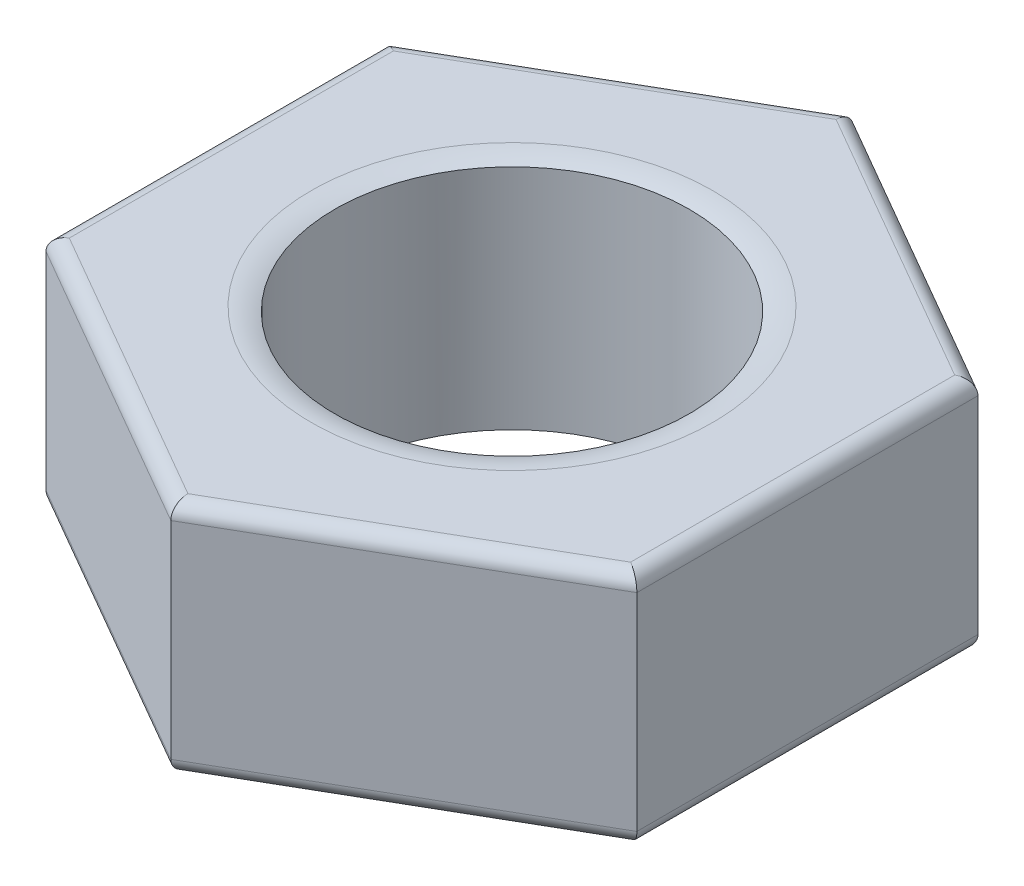
ISO-10303-21;
HEADER;
FILE_DESCRIPTION(('STEP AP214'),'2;1');
FILE_NAME('part.step','',(''),(''),'','','');
FILE_SCHEMA(('AUTOMOTIVE_DESIGN { 1 0 10303 214 1 1 1 1 }'));
ENDSEC;
DATA;
#1=APPLICATION_CONTEXT('core data for automotive mechanical design processes');
#2=APPLICATION_PROTOCOL_DEFINITION('international standard','automotive_design',2000,#1);
#3=PRODUCT_CONTEXT('',#1,'mechanical');
#4=PRODUCT('Part','Part','',(#3));
#5=PRODUCT_RELATED_PRODUCT_CATEGORY('part','',(#4));
#6=PRODUCT_DEFINITION_FORMATION('','',#4);
#7=PRODUCT_DEFINITION_CONTEXT('part definition',#1,'design');
#8=PRODUCT_DEFINITION('design','',#6,#7);
#9=PRODUCT_DEFINITION_SHAPE('','',#8);
#10=(LENGTH_UNIT() NAMED_UNIT(*) SI_UNIT(.MILLI.,.METRE.));
#11=(NAMED_UNIT(*) PLANE_ANGLE_UNIT() SI_UNIT($,.RADIAN.));
#12=(NAMED_UNIT(*) SI_UNIT($,.STERADIAN.) SOLID_ANGLE_UNIT());
#13=UNCERTAINTY_MEASURE_WITH_UNIT(LENGTH_MEASURE(1.E-05),#10,'distance_accuracy_value','');
#14=(GEOMETRIC_REPRESENTATION_CONTEXT(3) GLOBAL_UNCERTAINTY_ASSIGNED_CONTEXT((#13)) GLOBAL_UNIT_ASSIGNED_CONTEXT((#10,
#11,#12)) REPRESENTATION_CONTEXT('',''));
#15=CARTESIAN_POINT('',(0.,0.,0.));
#16=DIRECTION('',(0.,0.,1.));
#17=DIRECTION('',(1.,0.,0.));
#18=AXIS2_PLACEMENT_3D('',#15,#16,#17);
#19=CARTESIAN_POINT('',(0.,2.,0.));
#20=DIRECTION('',(0.,1.,0.));
#21=DIRECTION('',(0.,0.,1.));
#22=AXIS2_PLACEMENT_3D('',#19,#20,#21);
#23=PLANE('',#22);
#24=DIRECTION('',(0.,0.,-1.));
#25=VECTOR('',#24,1.);
#26=CARTESIAN_POINT('',(2.37499999999998,2.,-1.44337567297409));
#27=LINE('',#26,#25);
#28=CARTESIAN_POINT('',(2.37500000000001,2.,1.37120688932534));
#29=VERTEX_POINT('',#28);
#30=CARTESIAN_POINT('',(2.37499999999998,2.,-1.37120688932539));
#31=VERTEX_POINT('',#30);
#32=EDGE_CURVE('E44',#29,#31,#27,.T.);
#33=ORIENTED_EDGE('',*,*,#32,.T.);
#34=DIRECTION('',(-0.866025403784442,0.,-0.499999999999995));
#35=VECTOR('',#34,1.);
#36=CARTESIAN_POINT('',(-0.0624999999999998,2.,-2.77849817047507));
#37=LINE('',#36,#35);
#38=CARTESIAN_POINT('',(0.,2.,-2.74241377865072));
#39=VERTEX_POINT('',#38);
#40=EDGE_CURVE('E11',#31,#39,#37,.T.);
#41=ORIENTED_EDGE('',*,*,#40,.T.);
#42=DIRECTION('',(-0.866025403784438,0.,0.500000000000001));
#43=VECTOR('',#42,1.);
#44=CARTESIAN_POINT('',(-2.4375,2.,-1.335122497501));
#45=LINE('',#44,#43);
#46=CARTESIAN_POINT('',(-2.375,2.,-1.37120688932535));
#47=VERTEX_POINT('',#46);
#48=EDGE_CURVE('E208',#39,#47,#45,.T.);
#49=ORIENTED_EDGE('',*,*,#48,.T.);
#50=DIRECTION('',(0.,0.,1.));
#51=VECTOR('',#50,1.);
#52=CARTESIAN_POINT('',(-2.37499999999999,2.,1.44337567297407));
#53=LINE('',#52,#51);
#54=CARTESIAN_POINT('',(-2.37499999999999,2.,1.37120688932537));
#55=VERTEX_POINT('',#54);
#56=EDGE_CURVE('E210',#47,#55,#53,.T.);
#57=ORIENTED_EDGE('',*,*,#56,.T.);
#58=DIRECTION('',(0.866025403784441,0.,0.499999999999995));
#59=VECTOR('',#58,1.);
#60=CARTESIAN_POINT('',(0.0625000000000196,2.,2.77849817047507));
#61=LINE('',#60,#59);
#62=CARTESIAN_POINT('',(0.,2.,2.74241377865072));
#63=VERTEX_POINT('',#62);
#64=EDGE_CURVE('E212',#55,#63,#61,.T.);
#65=ORIENTED_EDGE('',*,*,#64,.T.);
#66=DIRECTION('',(0.866025403784435,0.,-0.500000000000007));
#67=VECTOR('',#66,1.);
#68=CARTESIAN_POINT('',(2.43750000000001,2.,1.33512249750098));
#69=LINE('',#68,#67);
#70=EDGE_CURVE('E55',#63,#29,#69,.T.);
#71=ORIENTED_EDGE('',*,*,#70,.T.);
#72=EDGE_LOOP('',(#33,#41,#49,#57,#65,#71));
#73=FACE_BOUND('',#72,.T.);
#74=CARTESIAN_POINT('',(0.,2.,0.));
#75=DIRECTION('',(0.,-1.,0.));
#76=DIRECTION('',(0.,0.,-1.));
#77=AXIS2_PLACEMENT_3D('',#74,#75,#76);
#78=CIRCLE('',#77,1.69948554329983);
#79=CARTESIAN_POINT('',(0.,2.,-1.69948554329983));
#80=VERTEX_POINT('',#79);
#81=EDGE_CURVE('E166',#80,#80,#78,.T.);
#82=ORIENTED_EDGE('',*,*,#81,.T.);
#83=EDGE_LOOP('',(#82));
#84=FACE_BOUND('',#83,.T.);
#85=ADVANCED_FACE('F35',(#73,#84),#23,.T.);
#86=CARTESIAN_POINT('',(0.,0.,0.));
#87=DIRECTION('',(0.,1.,0.));
#88=DIRECTION('',(0.,0.,1.));
#89=AXIS2_PLACEMENT_3D('',#86,#87,#88);
#90=PLANE('',#89);
#91=DIRECTION('',(-0.866025403784442,0.,-0.499999999999995));
#92=VECTOR('',#91,1.);
#93=CARTESIAN_POINT('',(1.18749999999999,0.,-2.05681033398805));
#94=LINE('',#93,#92);
#95=CARTESIAN_POINT('',(0.,0.,-2.74241377865072));
#96=VERTEX_POINT('',#95);
#97=CARTESIAN_POINT('',(2.37499999999998,0.,-1.37120688932539));
#98=VERTEX_POINT('',#97);
#99=EDGE_CURVE('E187',#96,#98,#94,.F.);
#100=ORIENTED_EDGE('',*,*,#99,.T.);
#101=DIRECTION('',(0.,0.,-1.));
#102=VECTOR('',#101,1.);
#103=CARTESIAN_POINT('',(2.37499999999999,0.,0.));
#104=LINE('',#103,#102);
#105=CARTESIAN_POINT('',(2.37500000000001,0.,1.37120688932534));
#106=VERTEX_POINT('',#105);
#107=EDGE_CURVE('E152',#98,#106,#104,.F.);
#108=ORIENTED_EDGE('',*,*,#107,.T.);
#109=DIRECTION('',(0.866025403784435,0.,-0.500000000000007));
#110=VECTOR('',#109,1.);
#111=CARTESIAN_POINT('',(1.18750000000001,0.,2.05681033398803));
#112=LINE('',#111,#110);
#113=CARTESIAN_POINT('',(0.,0.,2.74241377865072));
#114=VERTEX_POINT('',#113);
#115=EDGE_CURVE('E179',#106,#114,#112,.F.);
#116=ORIENTED_EDGE('',*,*,#115,.T.);
#117=DIRECTION('',(0.866025403784441,0.,0.499999999999995));
#118=VECTOR('',#117,1.);
#119=CARTESIAN_POINT('',(-1.18749999999999,0.,2.05681033398804));
#120=LINE('',#119,#118);
#121=CARTESIAN_POINT('',(-2.37499999999999,0.,1.37120688932537));
#122=VERTEX_POINT('',#121);
#123=EDGE_CURVE('E181',#114,#122,#120,.F.);
#124=ORIENTED_EDGE('',*,*,#123,.T.);
#125=DIRECTION('',(0.,0.,1.));
#126=VECTOR('',#125,1.);
#127=CARTESIAN_POINT('',(-2.37499999999999,0.,0.));
#128=LINE('',#127,#126);
#129=CARTESIAN_POINT('',(-2.375,0.,-1.37120688932535));
#130=VERTEX_POINT('',#129);
#131=EDGE_CURVE('E183',#122,#130,#128,.F.);
#132=ORIENTED_EDGE('',*,*,#131,.T.);
#133=DIRECTION('',(-0.866025403784438,0.,0.500000000000001));
#134=VECTOR('',#133,1.);
#135=CARTESIAN_POINT('',(-1.1875,0.,-2.05681033398804));
#136=LINE('',#135,#134);
#137=EDGE_CURVE('E185',#130,#96,#136,.F.);
#138=ORIENTED_EDGE('',*,*,#137,.T.);
#139=EDGE_LOOP('',(#100,#108,#116,#124,#132,#138));
#140=FACE_BOUND('',#139,.T.);
#141=CARTESIAN_POINT('',(0.,0.,0.));
#142=DIRECTION('',(0.,-1.,0.));
#143=DIRECTION('',(0.,0.,-1.));
#144=AXIS2_PLACEMENT_3D('',#141,#142,#143);
#145=CIRCLE('',#144,1.69948554329983);
#146=CARTESIAN_POINT('',(0.,0.,-1.69948554329983));
#147=VERTEX_POINT('',#146);
#148=EDGE_CURVE('E245',#147,#147,#145,.T.);
#149=ORIENTED_EDGE('',*,*,#148,.F.);
#150=EDGE_LOOP('',(#149));
#151=FACE_BOUND('',#150,.T.);
#152=ADVANCED_FACE('F253',(#140,#151),#90,.F.);
#153=CARTESIAN_POINT('',(2.49999999999998,2.,-1.44337567297409));
#154=DIRECTION('',(-0.499999999999995,0.,0.866025403784441));
#155=DIRECTION('',(0.866025403784442,0.,0.499999999999995));
#156=AXIS2_PLACEMENT_3D('',#153,#154,#155);
#157=PLANE('',#156);
#158=DIRECTION('',(0.,-1.,0.));
#159=VECTOR('',#158,1.);
#160=CARTESIAN_POINT('',(2.49999999999998,2.,-1.44337567297409));
#161=LINE('',#160,#159);
#162=CARTESIAN_POINT('',(2.49999999999998,1.875,-1.44337567297409));
#163=VERTEX_POINT('',#162);
#164=CARTESIAN_POINT('',(2.49999999999998,0.125,-1.44337567297409));
#165=VERTEX_POINT('',#164);
#166=EDGE_CURVE('E149',#163,#165,#161,.T.);
#167=ORIENTED_EDGE('',*,*,#166,.T.);
#168=DIRECTION('',(-0.866025403784442,0.,-0.499999999999995));
#169=VECTOR('',#168,1.);
#170=CARTESIAN_POINT('',(2.49999999999998,0.125,-1.44337567297409));
#171=LINE('',#170,#169);
#172=CARTESIAN_POINT('',(0.,0.125,-2.88675134594812));
#173=VERTEX_POINT('',#172);
#174=EDGE_CURVE('E151',#165,#173,#171,.T.);
#175=ORIENTED_EDGE('',*,*,#174,.T.);
#176=DIRECTION('',(0.,-1.,0.));
#177=VECTOR('',#176,1.);
#178=CARTESIAN_POINT('',(0.,2.,-2.88675134594812));
#179=LINE('',#178,#177);
#180=CARTESIAN_POINT('',(0.,1.875,-2.88675134594812));
#181=VERTEX_POINT('',#180);
#182=EDGE_CURVE('E143',#181,#173,#179,.T.);
#183=ORIENTED_EDGE('',*,*,#182,.F.);
#184=DIRECTION('',(-0.866025403784442,0.,-0.499999999999995));
#185=VECTOR('',#184,1.);
#186=CARTESIAN_POINT('',(2.49999999999998,1.875,-1.44337567297409));
#187=LINE('',#186,#185);
#188=EDGE_CURVE('E128',#181,#163,#187,.F.);
#189=ORIENTED_EDGE('',*,*,#188,.T.);
#190=EDGE_LOOP('',(#167,#175,#183,#189));
#191=FACE_BOUND('',#190,.T.);
#192=ADVANCED_FACE('F148',(#191),#157,.F.);
#193=CARTESIAN_POINT('',(0.,2.,-2.88675134594812));
#194=DIRECTION('',(0.500000000000001,0.,0.866025403784438));
#195=DIRECTION('',(0.866025403784438,0.,-0.500000000000001));
#196=AXIS2_PLACEMENT_3D('',#193,#194,#195);
#197=PLANE('',#196);
#198=ORIENTED_EDGE('',*,*,#182,.T.);
#199=DIRECTION('',(-0.866025403784438,0.,0.500000000000001));
#200=VECTOR('',#199,1.);
#201=CARTESIAN_POINT('',(0.,0.125,-2.88675134594812));
#202=LINE('',#201,#200);
#203=CARTESIAN_POINT('',(-2.5,0.125,-1.44337567297406));
#204=VERTEX_POINT('',#203);
#205=EDGE_CURVE('E194',#173,#204,#202,.T.);
#206=ORIENTED_EDGE('',*,*,#205,.T.);
#207=DIRECTION('',(0.,-1.,0.));
#208=VECTOR('',#207,1.);
#209=CARTESIAN_POINT('',(-2.5,2.,-1.44337567297406));
#210=LINE('',#209,#208);
#211=CARTESIAN_POINT('',(-2.5,1.875,-1.44337567297406));
#212=VERTEX_POINT('',#211);
#213=EDGE_CURVE('E174',#212,#204,#210,.T.);
#214=ORIENTED_EDGE('',*,*,#213,.F.);
#215=DIRECTION('',(-0.866025403784438,0.,0.500000000000001));
#216=VECTOR('',#215,1.);
#217=CARTESIAN_POINT('',(0.,1.875,-2.88675134594812));
#218=LINE('',#217,#216);
#219=EDGE_CURVE('E192',#212,#181,#218,.F.);
#220=ORIENTED_EDGE('',*,*,#219,.T.);
#221=EDGE_LOOP('',(#198,#206,#214,#220));
#222=FACE_BOUND('',#221,.T.);
#223=ADVANCED_FACE('F261',(#222),#197,.F.);
#224=CARTESIAN_POINT('',(-2.5,2.,-1.44337567297406));
#225=DIRECTION('',(1.,0.,0.));
#226=DIRECTION('',(0.,0.,-1.));
#227=AXIS2_PLACEMENT_3D('',#224,#225,#226);
#228=PLANE('',#227);
#229=ORIENTED_EDGE('',*,*,#213,.T.);
#230=DIRECTION('',(0.,0.,1.));
#231=VECTOR('',#230,1.);
#232=CARTESIAN_POINT('',(-2.5,0.125,-1.44337567297406));
#233=LINE('',#232,#231);
#234=CARTESIAN_POINT('',(-2.49999999999999,0.125,1.44337567297407));
#235=VERTEX_POINT('',#234);
#236=EDGE_CURVE('E198',#204,#235,#233,.T.);
#237=ORIENTED_EDGE('',*,*,#236,.T.);
#238=DIRECTION('',(0.,-1.,0.));
#239=VECTOR('',#238,1.);
#240=CARTESIAN_POINT('',(-2.49999999999999,2.,1.44337567297407));
#241=LINE('',#240,#239);
#242=CARTESIAN_POINT('',(-2.49999999999999,1.875,1.44337567297407));
#243=VERTEX_POINT('',#242);
#244=EDGE_CURVE('E171',#243,#235,#241,.T.);
#245=ORIENTED_EDGE('',*,*,#244,.F.);
#246=DIRECTION('',(0.,0.,1.));
#247=VECTOR('',#246,1.);
#248=CARTESIAN_POINT('',(-2.5,1.875,-1.44337567297406));
#249=LINE('',#248,#247);
#250=EDGE_CURVE('E196',#243,#212,#249,.F.);
#251=ORIENTED_EDGE('',*,*,#250,.T.);
#252=EDGE_LOOP('',(#229,#237,#245,#251));
#253=FACE_BOUND('',#252,.T.);
#254=ADVANCED_FACE('F276',(#253),#228,.F.);
#255=CARTESIAN_POINT('',(-2.49999999999999,2.,1.44337567297407));
#256=DIRECTION('',(0.499999999999995,0.,-0.866025403784441));
#257=DIRECTION('',(-0.866025403784441,0.,-0.499999999999995));
#258=AXIS2_PLACEMENT_3D('',#255,#256,#257);
#259=PLANE('',#258);
#260=ORIENTED_EDGE('',*,*,#244,.T.);
#261=DIRECTION('',(0.866025403784441,0.,0.499999999999995));
#262=VECTOR('',#261,1.);
#263=CARTESIAN_POINT('',(-2.49999999999999,0.125,1.44337567297407));
#264=LINE('',#263,#262);
#265=CARTESIAN_POINT('',(0.,0.125,2.88675134594812));
#266=VERTEX_POINT('',#265);
#267=EDGE_CURVE('E202',#235,#266,#264,.T.);
#268=ORIENTED_EDGE('',*,*,#267,.T.);
#269=DIRECTION('',(0.,-1.,0.));
#270=VECTOR('',#269,1.);
#271=CARTESIAN_POINT('',(0.,2.,2.88675134594812));
#272=LINE('',#271,#270);
#273=CARTESIAN_POINT('',(0.,1.875,2.88675134594812));
#274=VERTEX_POINT('',#273);
#275=EDGE_CURVE('E160',#274,#266,#272,.T.);
#276=ORIENTED_EDGE('',*,*,#275,.F.);
#277=DIRECTION('',(0.866025403784441,0.,0.499999999999995));
#278=VECTOR('',#277,1.);
#279=CARTESIAN_POINT('',(-2.49999999999999,1.875,1.44337567297407));
#280=LINE('',#279,#278);
#281=EDGE_CURVE('E200',#274,#243,#280,.F.);
#282=ORIENTED_EDGE('',*,*,#281,.T.);
#283=EDGE_LOOP('',(#260,#268,#276,#282));
#284=FACE_BOUND('',#283,.T.);
#285=ADVANCED_FACE('F272',(#284),#259,.F.);
#286=CARTESIAN_POINT('',(0.,2.,2.88675134594812));
#287=DIRECTION('',(-0.500000000000007,0.,-0.866025403784435));
#288=DIRECTION('',(-0.866025403784435,0.,0.500000000000007));
#289=AXIS2_PLACEMENT_3D('',#286,#287,#288);
#290=PLANE('',#289);
#291=ORIENTED_EDGE('',*,*,#275,.T.);
#292=DIRECTION('',(0.866025403784435,0.,-0.500000000000007));
#293=VECTOR('',#292,1.);
#294=CARTESIAN_POINT('',(0.,0.125,2.88675134594812));
#295=LINE('',#294,#293);
#296=CARTESIAN_POINT('',(2.50000000000001,0.125,1.44337567297404));
#297=VERTEX_POINT('',#296);
#298=EDGE_CURVE('E206',#266,#297,#295,.T.);
#299=ORIENTED_EDGE('',*,*,#298,.T.);
#300=DIRECTION('',(0.,-1.,0.));
#301=VECTOR('',#300,1.);
#302=CARTESIAN_POINT('',(2.50000000000001,2.,1.44337567297404));
#303=LINE('',#302,#301);
#304=CARTESIAN_POINT('',(2.50000000000001,1.875,1.44337567297404));
#305=VERTEX_POINT('',#304);
#306=EDGE_CURVE('E157',#305,#297,#303,.T.);
#307=ORIENTED_EDGE('',*,*,#306,.F.);
#308=DIRECTION('',(0.866025403784435,0.,-0.500000000000007));
#309=VECTOR('',#308,1.);
#310=CARTESIAN_POINT('',(0.,1.875,2.88675134594812));
#311=LINE('',#310,#309);
#312=EDGE_CURVE('E204',#305,#274,#311,.F.);
#313=ORIENTED_EDGE('',*,*,#312,.T.);
#314=EDGE_LOOP('',(#291,#299,#307,#313));
#315=FACE_BOUND('',#314,.T.);
#316=ADVANCED_FACE('F269',(#315),#290,.F.);
#317=CARTESIAN_POINT('',(2.50000000000001,2.,1.44337567297404));
#318=DIRECTION('',(-1.,0.,0.));
#319=DIRECTION('',(0.,0.,1.));
#320=AXIS2_PLACEMENT_3D('',#317,#318,#319);
#321=PLANE('',#320);
#322=ORIENTED_EDGE('',*,*,#306,.T.);
#323=DIRECTION('',(0.,0.,-1.));
#324=VECTOR('',#323,1.);
#325=CARTESIAN_POINT('',(2.50000000000001,0.125,1.44337567297404));
#326=LINE('',#325,#324);
#327=EDGE_CURVE('E142',#297,#165,#326,.T.);
#328=ORIENTED_EDGE('',*,*,#327,.T.);
#329=ORIENTED_EDGE('',*,*,#166,.F.);
#330=DIRECTION('',(0.,0.,-1.));
#331=VECTOR('',#330,1.);
#332=CARTESIAN_POINT('',(2.50000000000001,1.875,1.44337567297404));
#333=LINE('',#332,#331);
#334=EDGE_CURVE('E135',#163,#305,#333,.F.);
#335=ORIENTED_EDGE('',*,*,#334,.T.);
#336=EDGE_LOOP('',(#322,#328,#329,#335));
#337=FACE_BOUND('',#336,.T.);
#338=ADVANCED_FACE('F155',(#337),#321,.F.);
#339=CARTESIAN_POINT('',(0.,2.,0.));
#340=DIRECTION('',(0.,-1.,0.));
#341=DIRECTION('',(0.,0.,-1.));
#342=AXIS2_PLACEMENT_3D('',#339,#340,#341);
#343=CYLINDRICAL_SURFACE('',#342,1.5);
#344=CARTESIAN_POINT('',(0.,0.0364440834975765,0.));
#345=DIRECTION('',(0.,1.,0.));
#346=DIRECTION('',(0.,0.,1.));
#347=AXIS2_PLACEMENT_3D('',#344,#345,#346);
#348=CIRCLE('',#347,1.5);
#349=CARTESIAN_POINT('',(0.,0.0364440834975769,1.5));
#350=VERTEX_POINT('',#349);
#351=EDGE_CURVE('E39',#350,#350,#348,.T.);
#352=ORIENTED_EDGE('',*,*,#351,.F.);
#353=EDGE_LOOP('',(#352));
#354=FACE_BOUND('',#353,.T.);
#355=CARTESIAN_POINT('',(0.,1.96355591650242,0.));
#356=DIRECTION('',(0.,-1.,0.));
#357=DIRECTION('',(0.,0.,-1.));
#358=AXIS2_PLACEMENT_3D('',#355,#356,#357);
#359=CIRCLE('',#358,1.5);
#360=CARTESIAN_POINT('',(0.,1.96355591650242,-1.5));
#361=VERTEX_POINT('',#360);
#362=EDGE_CURVE('E229',#361,#361,#359,.T.);
#363=ORIENTED_EDGE('',*,*,#362,.F.);
#364=EDGE_LOOP('',(#363));
#365=FACE_BOUND('',#364,.T.);
#366=ADVANCED_FACE('F268',(#354,#365),#343,.F.);
#367=CARTESIAN_POINT('',(-2.375,0.125,-1.44337567297406));
#368=DIRECTION('',(0.,0.,1.));
#369=DIRECTION('',(1.,0.,0.));
#370=AXIS2_PLACEMENT_3D('',#367,#368,#369);
#371=CYLINDRICAL_SURFACE('',#370,0.125);
#372=CARTESIAN_POINT('',(-2.375,0.125,-1.37120688932535));
#373=DIRECTION('',(-0.499999999999998,0.,0.86602540378444));
#374=DIRECTION('',(0.86602540378444,0.,0.499999999999998));
#375=AXIS2_PLACEMENT_3D('',#372,#373,#374);
#376=ELLIPSE('',#375,0.144337567297407,0.125);
#377=EDGE_CURVE('E163',#130,#204,#376,.F.);
#378=ORIENTED_EDGE('',*,*,#377,.F.);
#379=ORIENTED_EDGE('',*,*,#131,.F.);
#380=CARTESIAN_POINT('',(-2.37499999999999,0.125,1.37120688932537));
#381=DIRECTION('',(0.500000000000004,0.,0.866025403784436));
#382=DIRECTION('',(0.866025403784436,0.,-0.500000000000004));
#383=AXIS2_PLACEMENT_3D('',#380,#381,#382);
#384=ELLIPSE('',#383,0.144337567297407,0.125);
#385=EDGE_CURVE('E158',#235,#122,#384,.T.);
#386=ORIENTED_EDGE('',*,*,#385,.F.);
#387=ORIENTED_EDGE('',*,*,#236,.F.);
#388=EDGE_LOOP('',(#378,#379,#386,#387));
#389=FACE_BOUND('',#388,.T.);
#390=ADVANCED_FACE('F303',(#389),#371,.T.);
#391=CARTESIAN_POINT('',(-2.43749999999999,0.125,1.33512249750102));
#392=DIRECTION('',(0.866025403784441,0.,0.499999999999995));
#393=DIRECTION('',(0.499999999999995,0.,-0.866025403784441));
#394=AXIS2_PLACEMENT_3D('',#391,#392,#393);
#395=CYLINDRICAL_SURFACE('',#394,0.125);
#396=ORIENTED_EDGE('',*,*,#385,.T.);
#397=ORIENTED_EDGE('',*,*,#123,.F.);
#398=CARTESIAN_POINT('',(0.,0.125,2.74241377865072));
#399=DIRECTION('',(1.,0.,0.));
#400=DIRECTION('',(0.,0.,-1.));
#401=AXIS2_PLACEMENT_3D('',#398,#399,#400);
#402=ELLIPSE('',#401,0.144337567297407,0.125);
#403=EDGE_CURVE('E224',#266,#114,#402,.T.);
#404=ORIENTED_EDGE('',*,*,#403,.F.);
#405=ORIENTED_EDGE('',*,*,#267,.F.);
#406=EDGE_LOOP('',(#396,#397,#404,#405));
#407=FACE_BOUND('',#406,.T.);
#408=ADVANCED_FACE('F299',(#407),#395,.T.);
#409=CARTESIAN_POINT('',(0.0625000000000001,0.125,-2.77849817047507));
#410=DIRECTION('',(-0.866025403784438,0.,0.500000000000001));
#411=DIRECTION('',(0.500000000000001,0.,0.866025403784438));
#412=AXIS2_PLACEMENT_3D('',#409,#410,#411);
#413=CYLINDRICAL_SURFACE('',#412,0.125);
#414=ORIENTED_EDGE('',*,*,#377,.T.);
#415=ORIENTED_EDGE('',*,*,#205,.F.);
#416=CARTESIAN_POINT('',(0.,0.125,-2.74241377865072));
#417=DIRECTION('',(-1.,0.,0.));
#418=DIRECTION('',(0.,0.,1.));
#419=AXIS2_PLACEMENT_3D('',#416,#417,#418);
#420=ELLIPSE('',#419,0.144337567297406,0.125);
#421=EDGE_CURVE('E221',#96,#173,#420,.F.);
#422=ORIENTED_EDGE('',*,*,#421,.F.);
#423=ORIENTED_EDGE('',*,*,#137,.F.);
#424=EDGE_LOOP('',(#414,#415,#422,#423));
#425=FACE_BOUND('',#424,.T.);
#426=ADVANCED_FACE('F295',(#425),#413,.T.);
#427=CARTESIAN_POINT('',(-0.0624999999999808,0.125,2.77849817047507));
#428=DIRECTION('',(0.866025403784435,0.,-0.500000000000007));
#429=DIRECTION('',(-0.500000000000007,0.,-0.866025403784435));
#430=AXIS2_PLACEMENT_3D('',#427,#428,#429);
#431=CYLINDRICAL_SURFACE('',#430,0.125);
#432=ORIENTED_EDGE('',*,*,#403,.T.);
#433=ORIENTED_EDGE('',*,*,#115,.F.);
#434=CARTESIAN_POINT('',(2.37500000000001,0.125,1.37120688932534));
#435=DIRECTION('',(0.499999999999992,0.,-0.866025403784443));
#436=DIRECTION('',(0.866025403784443,0.,0.499999999999992));
#437=AXIS2_PLACEMENT_3D('',#434,#435,#436);
#438=ELLIPSE('',#437,0.144337567297407,0.125);
#439=EDGE_CURVE('E218',#297,#106,#438,.T.);
#440=ORIENTED_EDGE('',*,*,#439,.F.);
#441=ORIENTED_EDGE('',*,*,#298,.F.);
#442=EDGE_LOOP('',(#432,#433,#440,#441));
#443=FACE_BOUND('',#442,.T.);
#444=ADVANCED_FACE('F291',(#443),#431,.T.);
#445=CARTESIAN_POINT('',(2.43749999999998,0.125,-1.33512249750104));
#446=DIRECTION('',(-0.866025403784442,0.,-0.499999999999995));
#447=DIRECTION('',(-0.499999999999995,0.,0.866025403784441));
#448=AXIS2_PLACEMENT_3D('',#445,#446,#447);
#449=CYLINDRICAL_SURFACE('',#448,0.125);
#450=ORIENTED_EDGE('',*,*,#421,.T.);
#451=ORIENTED_EDGE('',*,*,#174,.F.);
#452=CARTESIAN_POINT('',(2.37499999999998,0.125,-1.37120688932539));
#453=DIRECTION('',(-0.500000000000007,0.,-0.866025403784435));
#454=DIRECTION('',(-0.866025403784435,0.,0.500000000000007));
#455=AXIS2_PLACEMENT_3D('',#452,#453,#454);
#456=ELLIPSE('',#455,0.144337567297406,0.125);
#457=EDGE_CURVE('E216',#98,#165,#456,.F.);
#458=ORIENTED_EDGE('',*,*,#457,.F.);
#459=ORIENTED_EDGE('',*,*,#99,.F.);
#460=EDGE_LOOP('',(#450,#451,#458,#459));
#461=FACE_BOUND('',#460,.T.);
#462=ADVANCED_FACE('F287',(#461),#449,.T.);
#463=CARTESIAN_POINT('',(2.37500000000001,0.125,1.44337567297404));
#464=DIRECTION('',(0.,0.,-1.));
#465=DIRECTION('',(-1.,0.,0.));
#466=AXIS2_PLACEMENT_3D('',#463,#464,#465);
#467=CYLINDRICAL_SURFACE('',#466,0.125);
#468=ORIENTED_EDGE('',*,*,#439,.T.);
#469=ORIENTED_EDGE('',*,*,#107,.F.);
#470=ORIENTED_EDGE('',*,*,#457,.T.);
#471=ORIENTED_EDGE('',*,*,#327,.F.);
#472=EDGE_LOOP('',(#468,#469,#470,#471));
#473=FACE_BOUND('',#472,.T.);
#474=ADVANCED_FACE('F284',(#473),#467,.T.);
#475=CARTESIAN_POINT('',(-1.18749999999999,1.875,2.05681033398804));
#476=DIRECTION('',(-0.866025403784441,0.,-0.499999999999995));
#477=DIRECTION('',(-0.499999999999995,0.,0.866025403784441));
#478=AXIS2_PLACEMENT_3D('',#475,#476,#477);
#479=CYLINDRICAL_SURFACE('',#478,0.125);
#480=CARTESIAN_POINT('',(-2.37499999999999,1.875,1.37120688932537));
#481=DIRECTION('',(-0.500000000000004,0.,-0.866025403784436));
#482=DIRECTION('',(0.866025403784436,0.,-0.500000000000004));
#483=AXIS2_PLACEMENT_3D('',#480,#481,#482);
#484=ELLIPSE('',#483,0.144337567297407,0.125);
#485=EDGE_CURVE('E234',#243,#55,#484,.T.);
#486=ORIENTED_EDGE('',*,*,#485,.F.);
#487=ORIENTED_EDGE('',*,*,#281,.F.);
#488=CARTESIAN_POINT('',(0.,1.875,2.74241377865072));
#489=DIRECTION('',(-1.,0.,0.));
#490=DIRECTION('',(0.,0.,-1.));
#491=AXIS2_PLACEMENT_3D('',#488,#489,#490);
#492=ELLIPSE('',#491,0.144337567297407,0.125);
#493=EDGE_CURVE('E219',#63,#274,#492,.F.);
#494=ORIENTED_EDGE('',*,*,#493,.F.);
#495=ORIENTED_EDGE('',*,*,#64,.F.);
#496=EDGE_LOOP('',(#486,#487,#494,#495));
#497=FACE_BOUND('',#496,.T.);
#498=ADVANCED_FACE('F37',(#497),#479,.T.);
#499=CARTESIAN_POINT('',(1.18750000000001,1.875,2.05681033398803));
#500=DIRECTION('',(-0.866025403784435,0.,0.500000000000007));
#501=DIRECTION('',(0.500000000000007,0.,0.866025403784435));
#502=AXIS2_PLACEMENT_3D('',#499,#500,#501);
#503=CYLINDRICAL_SURFACE('',#502,0.125);
#504=ORIENTED_EDGE('',*,*,#493,.T.);
#505=ORIENTED_EDGE('',*,*,#312,.F.);
#506=CARTESIAN_POINT('',(2.37500000000001,1.875,1.37120688932534));
#507=DIRECTION('',(-0.499999999999992,0.,0.866025403784443));
#508=DIRECTION('',(-0.866025403784443,0.,-0.499999999999992));
#509=AXIS2_PLACEMENT_3D('',#506,#507,#508);
#510=ELLIPSE('',#509,0.144337567297407,0.125);
#511=EDGE_CURVE('E137',#29,#305,#510,.F.);
#512=ORIENTED_EDGE('',*,*,#511,.F.);
#513=ORIENTED_EDGE('',*,*,#70,.F.);
#514=EDGE_LOOP('',(#504,#505,#512,#513));
#515=FACE_BOUND('',#514,.T.);
#516=ADVANCED_FACE('F319',(#515),#503,.T.);
#517=CARTESIAN_POINT('',(-2.37499999999999,1.875,0.));
#518=DIRECTION('',(0.,0.,-1.));
#519=DIRECTION('',(-1.,0.,0.));
#520=AXIS2_PLACEMENT_3D('',#517,#518,#519);
#521=CYLINDRICAL_SURFACE('',#520,0.125);
#522=ORIENTED_EDGE('',*,*,#485,.T.);
#523=ORIENTED_EDGE('',*,*,#56,.F.);
#524=CARTESIAN_POINT('',(-2.375,1.875,-1.37120688932535));
#525=DIRECTION('',(0.499999999999998,0.,-0.86602540378444));
#526=DIRECTION('',(0.86602540378444,0.,0.499999999999998));
#527=AXIS2_PLACEMENT_3D('',#524,#525,#526);
#528=ELLIPSE('',#527,0.144337567297407,0.125);
#529=EDGE_CURVE('E131',#212,#47,#528,.T.);
#530=ORIENTED_EDGE('',*,*,#529,.F.);
#531=ORIENTED_EDGE('',*,*,#250,.F.);
#532=EDGE_LOOP('',(#522,#523,#530,#531));
#533=FACE_BOUND('',#532,.T.);
#534=ADVANCED_FACE('F317',(#533),#521,.T.);
#535=CARTESIAN_POINT('',(2.37499999999999,1.875,0.));
#536=DIRECTION('',(0.,0.,1.));
#537=DIRECTION('',(1.,0.,0.));
#538=AXIS2_PLACEMENT_3D('',#535,#536,#537);
#539=CYLINDRICAL_SURFACE('',#538,0.125);
#540=ORIENTED_EDGE('',*,*,#511,.T.);
#541=ORIENTED_EDGE('',*,*,#334,.F.);
#542=CARTESIAN_POINT('',(2.37499999999998,1.875,-1.37120688932539));
#543=DIRECTION('',(0.500000000000007,0.,0.866025403784435));
#544=DIRECTION('',(-0.866025403784435,0.,0.500000000000007));
#545=AXIS2_PLACEMENT_3D('',#542,#543,#544);
#546=ELLIPSE('',#545,0.144337567297406,0.125);
#547=EDGE_CURVE('E124',#31,#163,#546,.F.);
#548=ORIENTED_EDGE('',*,*,#547,.F.);
#549=ORIENTED_EDGE('',*,*,#32,.F.);
#550=EDGE_LOOP('',(#540,#541,#548,#549));
#551=FACE_BOUND('',#550,.T.);
#552=ADVANCED_FACE('F136',(#551),#539,.T.);
#553=CARTESIAN_POINT('',(-1.1875,1.875,-2.05681033398804));
#554=DIRECTION('',(0.866025403784438,0.,-0.500000000000001));
#555=DIRECTION('',(-0.500000000000001,0.,-0.866025403784438));
#556=AXIS2_PLACEMENT_3D('',#553,#554,#555);
#557=CYLINDRICAL_SURFACE('',#556,0.125);
#558=ORIENTED_EDGE('',*,*,#529,.T.);
#559=ORIENTED_EDGE('',*,*,#48,.F.);
#560=CARTESIAN_POINT('',(0.,1.875,-2.74241377865072));
#561=DIRECTION('',(1.,0.,0.));
#562=DIRECTION('',(0.,0.,-1.));
#563=AXIS2_PLACEMENT_3D('',#560,#561,#562);
#564=ELLIPSE('',#563,0.144337567297406,0.125);
#565=EDGE_CURVE('E132',#181,#39,#564,.T.);
#566=ORIENTED_EDGE('',*,*,#565,.F.);
#567=ORIENTED_EDGE('',*,*,#219,.F.);
#568=EDGE_LOOP('',(#558,#559,#566,#567));
#569=FACE_BOUND('',#568,.T.);
#570=ADVANCED_FACE('F311',(#569),#557,.T.);
#571=CARTESIAN_POINT('',(1.18749999999999,1.875,-2.05681033398805));
#572=DIRECTION('',(0.866025403784442,0.,0.499999999999995));
#573=DIRECTION('',(0.499999999999995,0.,-0.866025403784441));
#574=AXIS2_PLACEMENT_3D('',#571,#572,#573);
#575=CYLINDRICAL_SURFACE('',#574,0.125);
#576=ORIENTED_EDGE('',*,*,#547,.T.);
#577=ORIENTED_EDGE('',*,*,#188,.F.);
#578=ORIENTED_EDGE('',*,*,#565,.T.);
#579=ORIENTED_EDGE('',*,*,#40,.F.);
#580=EDGE_LOOP('',(#576,#577,#578,#579));
#581=FACE_BOUND('',#580,.T.);
#582=ADVANCED_FACE('F126',(#581),#575,.T.);
#583=CARTESIAN_POINT('',(0.,1.43581167008434,0.));
#584=DIRECTION('',(0.,-1.,0.));
#585=DIRECTION('',(0.,0.,-1.));
#586=AXIS2_PLACEMENT_3D('',#583,#584,#585);
#587=TOROIDAL_SURFACE('',#586,1.69948554329983,0.56418832991566);
#588=ORIENTED_EDGE('',*,*,#362,.T.);
#589=EDGE_LOOP('',(#588));
#590=FACE_BOUND('',#589,.T.);
#591=ORIENTED_EDGE('',*,*,#81,.F.);
#592=EDGE_LOOP('',(#591));
#593=FACE_BOUND('',#592,.T.);
#594=ADVANCED_FACE('F310',(#590,#593),#587,.T.);
#595=CARTESIAN_POINT('',(0.,0.56418832991566,0.));
#596=DIRECTION('',(0.,-1.,0.));
#597=DIRECTION('',(0.,0.,-1.));
#598=AXIS2_PLACEMENT_3D('',#595,#596,#597);
#599=TOROIDAL_SURFACE('',#598,1.69948554329983,0.56418832991566);
#600=ORIENTED_EDGE('',*,*,#351,.T.);
#601=EDGE_LOOP('',(#600));
#602=FACE_BOUND('',#601,.T.);
#603=ORIENTED_EDGE('',*,*,#148,.T.);
#604=EDGE_LOOP('',(#603));
#605=FACE_BOUND('',#604,.T.);
#606=ADVANCED_FACE('F251',(#602,#605),#599,.T.);
#607=CLOSED_SHELL('',(#85,#152,#192,#223,#254,#285,#316,#338,#366,#390,#408,#426,#444,#462,#474,
#498,#516,#534,#552,#570,#582,#594,#606));
#608=MANIFOLD_SOLID_BREP('B2',#607);
#609=ADVANCED_BREP_SHAPE_REPRESENTATION('',(#18,#608),#14);
#610=SHAPE_DEFINITION_REPRESENTATION(#9,#609);
ENDSEC;
END-ISO-10303-21;
